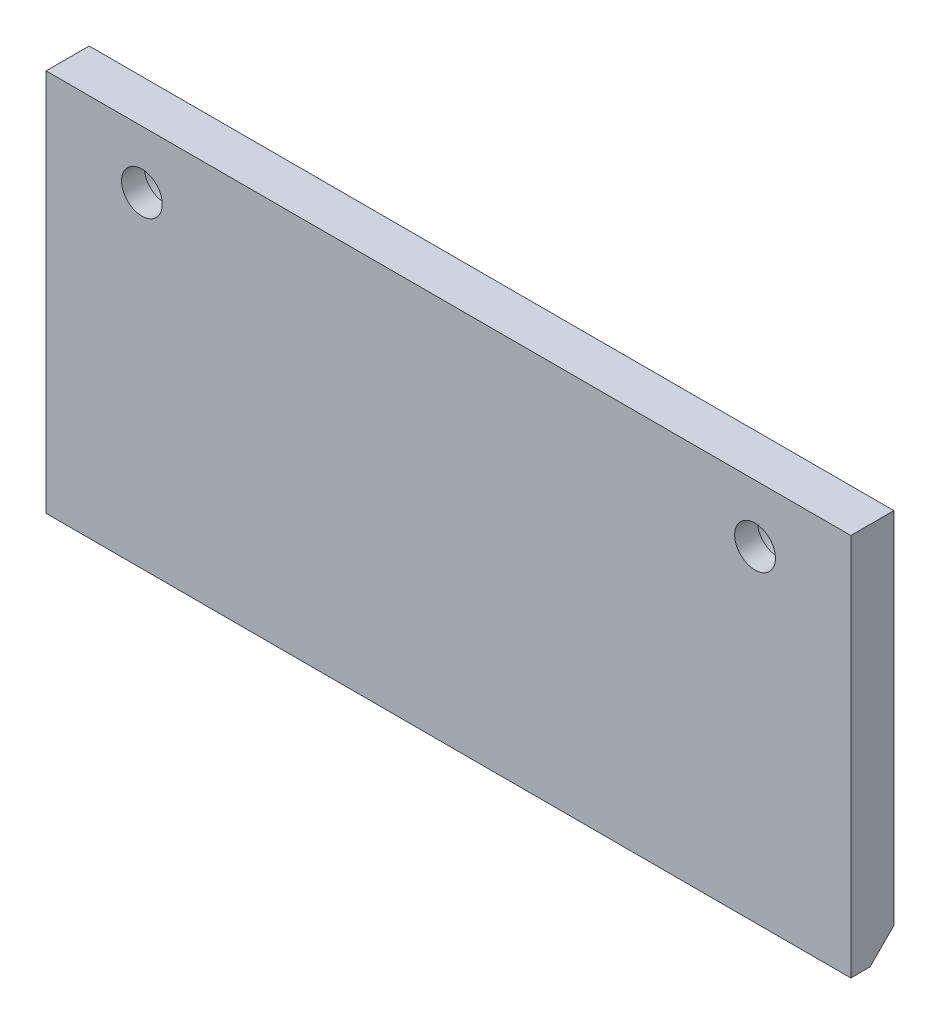
ISO-10303-21;
HEADER;
FILE_DESCRIPTION(('STEP AP214'),'2;1');
FILE_NAME('part.step','',(''),(''),'','','');
FILE_SCHEMA(('AUTOMOTIVE_DESIGN { 1 0 10303 214 1 1 1 1 }'));
ENDSEC;
DATA;
#1=APPLICATION_CONTEXT('core data for automotive mechanical design processes');
#2=APPLICATION_PROTOCOL_DEFINITION('international standard','automotive_design',2000,#1);
#3=PRODUCT_CONTEXT('',#1,'mechanical');
#4=PRODUCT('Part','Part','',(#3));
#5=PRODUCT_RELATED_PRODUCT_CATEGORY('part','',(#4));
#6=PRODUCT_DEFINITION_FORMATION('','',#4);
#7=PRODUCT_DEFINITION_CONTEXT('part definition',#1,'design');
#8=PRODUCT_DEFINITION('design','',#6,#7);
#9=PRODUCT_DEFINITION_SHAPE('','',#8);
#10=(LENGTH_UNIT() NAMED_UNIT(*) SI_UNIT(.MILLI.,.METRE.));
#11=(NAMED_UNIT(*) PLANE_ANGLE_UNIT() SI_UNIT($,.RADIAN.));
#12=(NAMED_UNIT(*) SI_UNIT($,.STERADIAN.) SOLID_ANGLE_UNIT());
#13=UNCERTAINTY_MEASURE_WITH_UNIT(LENGTH_MEASURE(1.E-05),#10,'distance_accuracy_value','');
#14=(GEOMETRIC_REPRESENTATION_CONTEXT(3) GLOBAL_UNCERTAINTY_ASSIGNED_CONTEXT((#13)) GLOBAL_UNIT_ASSIGNED_CONTEXT((#10,
#11,#12)) REPRESENTATION_CONTEXT('',''));
#15=CARTESIAN_POINT('',(0.,0.,0.));
#16=DIRECTION('',(0.,0.,1.));
#17=DIRECTION('',(1.,0.,0.));
#18=AXIS2_PLACEMENT_3D('',#15,#16,#17);
#19=CARTESIAN_POINT('',(-66.675,31.75,-3.5687));
#20=DIRECTION('',(-1.,0.,0.));
#21=DIRECTION('',(0.,-1.,0.));
#22=AXIS2_PLACEMENT_3D('',#19,#20,#21);
#23=PLANE('',#22);
#24=DIRECTION('',(0.,0.707106781186544,-0.707106781186551));
#25=VECTOR('',#24,1.);
#26=CARTESIAN_POINT('',(-66.675,-31.75,0.3937));
#27=LINE('',#26,#25);
#28=CARTESIAN_POINT('',(-66.675,-31.75,0.3937));
#29=VERTEX_POINT('',#28);
#30=CARTESIAN_POINT('',(-66.675,-27.7876,-3.5687));
#31=VERTEX_POINT('',#30);
#32=EDGE_CURVE('E59',#29,#31,#27,.T.);
#33=ORIENTED_EDGE('',*,*,#32,.F.);
#34=DIRECTION('',(0.,0.,1.));
#35=VECTOR('',#34,1.);
#36=CARTESIAN_POINT('',(-66.675,-31.75,-3.5687));
#37=LINE('',#36,#35);
#38=CARTESIAN_POINT('',(-66.675,-31.75,3.5687));
#39=VERTEX_POINT('',#38);
#40=EDGE_CURVE('E46',#29,#39,#37,.T.);
#41=ORIENTED_EDGE('',*,*,#40,.T.);
#42=DIRECTION('',(0.,-1.,0.));
#43=VECTOR('',#42,1.);
#44=CARTESIAN_POINT('',(-66.675,31.75,3.5687));
#45=LINE('',#44,#43);
#46=CARTESIAN_POINT('',(-66.675,31.75,3.5687));
#47=VERTEX_POINT('',#46);
#48=EDGE_CURVE('E92',#47,#39,#45,.T.);
#49=ORIENTED_EDGE('',*,*,#48,.F.);
#50=DIRECTION('',(0.,0.,1.));
#51=VECTOR('',#50,1.);
#52=CARTESIAN_POINT('',(-66.675,31.75,-3.5687));
#53=LINE('',#52,#51);
#54=CARTESIAN_POINT('',(-66.675,31.75,-3.5687));
#55=VERTEX_POINT('',#54);
#56=EDGE_CURVE('E11',#55,#47,#53,.T.);
#57=ORIENTED_EDGE('',*,*,#56,.F.);
#58=DIRECTION('',(0.,-1.,0.));
#59=VECTOR('',#58,1.);
#60=CARTESIAN_POINT('',(-66.675,31.75,-3.5687));
#61=LINE('',#60,#59);
#62=EDGE_CURVE('E104',#55,#31,#61,.T.);
#63=ORIENTED_EDGE('',*,*,#62,.T.);
#64=EDGE_LOOP('',(#33,#41,#49,#57,#63));
#65=FACE_BOUND('',#64,.T.);
#66=ADVANCED_FACE('F43',(#65),#23,.T.);
#67=CARTESIAN_POINT('',(66.675,31.75,-3.5687));
#68=DIRECTION('',(0.,1.,0.));
#69=DIRECTION('',(-1.,0.,0.));
#70=AXIS2_PLACEMENT_3D('',#67,#68,#69);
#71=PLANE('',#70);
#72=DIRECTION('',(-1.,0.,0.));
#73=VECTOR('',#72,1.);
#74=CARTESIAN_POINT('',(66.675,31.75,3.5687));
#75=LINE('',#74,#73);
#76=CARTESIAN_POINT('',(66.675,31.75,3.5687));
#77=VERTEX_POINT('',#76);
#78=EDGE_CURVE('E88',#77,#47,#75,.T.);
#79=ORIENTED_EDGE('',*,*,#78,.F.);
#80=DIRECTION('',(0.,0.,1.));
#81=VECTOR('',#80,1.);
#82=CARTESIAN_POINT('',(66.675,31.75,-3.5687));
#83=LINE('',#82,#81);
#84=CARTESIAN_POINT('',(66.675,31.75,-3.5687));
#85=VERTEX_POINT('',#84);
#86=EDGE_CURVE('E51',#85,#77,#83,.T.);
#87=ORIENTED_EDGE('',*,*,#86,.F.);
#88=DIRECTION('',(-1.,0.,0.));
#89=VECTOR('',#88,1.);
#90=CARTESIAN_POINT('',(66.675,31.75,-3.5687));
#91=LINE('',#90,#89);
#92=EDGE_CURVE('E90',#85,#55,#91,.T.);
#93=ORIENTED_EDGE('',*,*,#92,.T.);
#94=ORIENTED_EDGE('',*,*,#56,.T.);
#95=EDGE_LOOP('',(#79,#87,#93,#94));
#96=FACE_BOUND('',#95,.T.);
#97=ADVANCED_FACE('F85',(#96),#71,.T.);
#98=CARTESIAN_POINT('',(66.675,31.75,-3.5687));
#99=DIRECTION('',(1.,0.,0.));
#100=DIRECTION('',(0.,1.,0.));
#101=AXIS2_PLACEMENT_3D('',#98,#99,#100);
#102=PLANE('',#101);
#103=DIRECTION('',(0.,0.707106781186544,-0.707106781186551));
#104=VECTOR('',#103,1.);
#105=CARTESIAN_POINT('',(66.675,-31.75,0.3937));
#106=LINE('',#105,#104);
#107=CARTESIAN_POINT('',(66.675,-31.75,0.3937));
#108=VERTEX_POINT('',#107);
#109=CARTESIAN_POINT('',(66.675,-27.7876,-3.5687));
#110=VERTEX_POINT('',#109);
#111=EDGE_CURVE('E126',#108,#110,#106,.T.);
#112=ORIENTED_EDGE('',*,*,#111,.T.);
#113=DIRECTION('',(0.,1.,0.));
#114=VECTOR('',#113,1.);
#115=CARTESIAN_POINT('',(66.675,31.75,-3.5687));
#116=LINE('',#115,#114);
#117=EDGE_CURVE('E106',#110,#85,#116,.T.);
#118=ORIENTED_EDGE('',*,*,#117,.T.);
#119=ORIENTED_EDGE('',*,*,#86,.T.);
#120=DIRECTION('',(0.,1.,0.));
#121=VECTOR('',#120,1.);
#122=CARTESIAN_POINT('',(66.675,31.75,3.5687));
#123=LINE('',#122,#121);
#124=CARTESIAN_POINT('',(66.675,-31.75,3.5687));
#125=VERTEX_POINT('',#124);
#126=EDGE_CURVE('E103',#125,#77,#123,.T.);
#127=ORIENTED_EDGE('',*,*,#126,.F.);
#128=DIRECTION('',(0.,0.,1.));
#129=VECTOR('',#128,1.);
#130=CARTESIAN_POINT('',(66.675,-31.75,-3.5687));
#131=LINE('',#130,#129);
#132=EDGE_CURVE('E111',#108,#125,#131,.T.);
#133=ORIENTED_EDGE('',*,*,#132,.F.);
#134=EDGE_LOOP('',(#112,#118,#119,#127,#133));
#135=FACE_BOUND('',#134,.T.);
#136=ADVANCED_FACE('F131',(#135),#102,.T.);
#137=CARTESIAN_POINT('',(66.675,-31.75,-3.5687));
#138=DIRECTION('',(0.,-1.,0.));
#139=DIRECTION('',(1.,0.,0.));
#140=AXIS2_PLACEMENT_3D('',#137,#138,#139);
#141=PLANE('',#140);
#142=DIRECTION('',(-1.,0.,0.));
#143=VECTOR('',#142,1.);
#144=CARTESIAN_POINT('',(66.675,-31.75,0.3937));
#145=LINE('',#144,#143);
#146=EDGE_CURVE('E120',#108,#29,#145,.T.);
#147=ORIENTED_EDGE('',*,*,#146,.F.);
#148=ORIENTED_EDGE('',*,*,#132,.T.);
#149=DIRECTION('',(1.,0.,0.));
#150=VECTOR('',#149,1.);
#151=CARTESIAN_POINT('',(66.675,-31.75,3.5687));
#152=LINE('',#151,#150);
#153=EDGE_CURVE('E97',#39,#125,#152,.T.);
#154=ORIENTED_EDGE('',*,*,#153,.F.);
#155=ORIENTED_EDGE('',*,*,#40,.F.);
#156=EDGE_LOOP('',(#147,#148,#154,#155));
#157=FACE_BOUND('',#156,.T.);
#158=ADVANCED_FACE('F117',(#157),#141,.T.);
#159=CARTESIAN_POINT('',(0.,0.,-3.5687));
#160=DIRECTION('',(0.,0.,-1.));
#161=DIRECTION('',(-1.,0.,0.));
#162=AXIS2_PLACEMENT_3D('',#159,#160,#161);
#163=PLANE('',#162);
#164=CARTESIAN_POINT('',(50.8,22.225,-3.5687));
#165=DIRECTION('',(0.,0.,-1.));
#166=DIRECTION('',(-1.,0.,0.));
#167=AXIS2_PLACEMENT_3D('',#164,#165,#166);
#168=CIRCLE('',#167,5.95376);
#169=CARTESIAN_POINT('',(44.84624,22.225,-3.5687));
#170=VERTEX_POINT('',#169);
#171=EDGE_CURVE('E158',#170,#170,#168,.T.);
#172=ORIENTED_EDGE('',*,*,#171,.F.);
#173=EDGE_LOOP('',(#172));
#174=FACE_BOUND('',#173,.T.);
#175=CARTESIAN_POINT('',(-50.8,22.225,-3.5687));
#176=DIRECTION('',(0.,0.,-1.));
#177=DIRECTION('',(-1.,0.,0.));
#178=AXIS2_PLACEMENT_3D('',#175,#176,#177);
#179=CIRCLE('',#178,5.95376);
#180=CARTESIAN_POINT('',(-56.75376,22.225,-3.5687));
#181=VERTEX_POINT('',#180);
#182=EDGE_CURVE('E146',#181,#181,#179,.T.);
#183=ORIENTED_EDGE('',*,*,#182,.F.);
#184=EDGE_LOOP('',(#183));
#185=FACE_BOUND('',#184,.T.);
#186=DIRECTION('',(-1.,0.,0.));
#187=VECTOR('',#186,1.);
#188=CARTESIAN_POINT('',(66.675,-27.7876,-3.5687));
#189=LINE('',#188,#187);
#190=EDGE_CURVE('E98',#110,#31,#189,.T.);
#191=ORIENTED_EDGE('',*,*,#190,.T.);
#192=ORIENTED_EDGE('',*,*,#62,.F.);
#193=ORIENTED_EDGE('',*,*,#92,.F.);
#194=ORIENTED_EDGE('',*,*,#117,.F.);
#195=EDGE_LOOP('',(#191,#192,#193,#194));
#196=FACE_BOUND('',#195,.T.);
#197=ADVANCED_FACE('F133',(#174,#185,#196),#163,.T.);
#198=CARTESIAN_POINT('',(0.,0.,3.5687));
#199=DIRECTION('',(0.,0.,-1.));
#200=DIRECTION('',(-1.,0.,0.));
#201=AXIS2_PLACEMENT_3D('',#198,#199,#200);
#202=PLANE('',#201);
#203=CARTESIAN_POINT('',(50.8,22.225,3.5687));
#204=DIRECTION('',(0.,0.,-1.));
#205=DIRECTION('',(-1.,0.,0.));
#206=AXIS2_PLACEMENT_3D('',#203,#204,#205);
#207=CIRCLE('',#206,3.3782);
#208=CARTESIAN_POINT('',(47.4218,22.225,3.5687));
#209=VERTEX_POINT('',#208);
#210=EDGE_CURVE('E149',#209,#209,#207,.T.);
#211=ORIENTED_EDGE('',*,*,#210,.T.);
#212=EDGE_LOOP('',(#211));
#213=FACE_BOUND('',#212,.T.);
#214=CARTESIAN_POINT('',(-50.8,22.225,3.5687));
#215=DIRECTION('',(0.,0.,-1.));
#216=DIRECTION('',(-1.,0.,0.));
#217=AXIS2_PLACEMENT_3D('',#214,#215,#216);
#218=CIRCLE('',#217,3.3782);
#219=CARTESIAN_POINT('',(-54.1782,22.225,3.5687));
#220=VERTEX_POINT('',#219);
#221=EDGE_CURVE('E134',#220,#220,#218,.T.);
#222=ORIENTED_EDGE('',*,*,#221,.T.);
#223=EDGE_LOOP('',(#222));
#224=FACE_BOUND('',#223,.T.);
#225=ORIENTED_EDGE('',*,*,#48,.T.);
#226=ORIENTED_EDGE('',*,*,#153,.T.);
#227=ORIENTED_EDGE('',*,*,#126,.T.);
#228=ORIENTED_EDGE('',*,*,#78,.T.);
#229=EDGE_LOOP('',(#225,#226,#227,#228));
#230=FACE_BOUND('',#229,.T.);
#231=ADVANCED_FACE('F101',(#213,#224,#230),#202,.F.);
#232=CARTESIAN_POINT('',(66.675,-31.75,0.3937));
#233=DIRECTION('',(0.,0.707106781186551,0.707106781186544));
#234=DIRECTION('',(0.,-0.707106781186544,0.707106781186551));
#235=AXIS2_PLACEMENT_3D('',#232,#233,#234);
#236=PLANE('',#235);
#237=ORIENTED_EDGE('',*,*,#32,.T.);
#238=ORIENTED_EDGE('',*,*,#190,.F.);
#239=ORIENTED_EDGE('',*,*,#111,.F.);
#240=ORIENTED_EDGE('',*,*,#146,.T.);
#241=EDGE_LOOP('',(#237,#238,#239,#240));
#242=FACE_BOUND('',#241,.T.);
#243=ADVANCED_FACE('F125',(#242),#236,.F.);
#244=CARTESIAN_POINT('',(-50.8,22.225,-3.5687));
#245=DIRECTION('',(0.,0.,-1.));
#246=DIRECTION('',(-1.,0.,0.));
#247=AXIS2_PLACEMENT_3D('',#244,#245,#246);
#248=CYLINDRICAL_SURFACE('',#247,3.3782);
#249=ORIENTED_EDGE('',*,*,#221,.F.);
#250=EDGE_LOOP('',(#249));
#251=FACE_BOUND('',#250,.T.);
#252=CARTESIAN_POINT('',(-50.8,22.225,-0.215900000000001));
#253=DIRECTION('',(0.,0.,-1.));
#254=DIRECTION('',(-1.,0.,0.));
#255=AXIS2_PLACEMENT_3D('',#252,#253,#254);
#256=CIRCLE('',#255,3.3782);
#257=CARTESIAN_POINT('',(-54.1782,22.225,-0.215900000000001));
#258=VERTEX_POINT('',#257);
#259=EDGE_CURVE('E137',#258,#258,#256,.T.);
#260=ORIENTED_EDGE('',*,*,#259,.T.);
#261=EDGE_LOOP('',(#260));
#262=FACE_BOUND('',#261,.T.);
#263=ADVANCED_FACE('F182',(#251,#262),#248,.F.);
#264=CARTESIAN_POINT('',(-47.4218,22.225,-0.215900000000001));
#265=DIRECTION('',(0.,0.,1.));
#266=DIRECTION('',(1.,0.,0.));
#267=AXIS2_PLACEMENT_3D('',#264,#265,#266);
#268=PLANE('',#267);
#269=ORIENTED_EDGE('',*,*,#259,.F.);
#270=EDGE_LOOP('',(#269));
#271=FACE_BOUND('',#270,.T.);
#272=CARTESIAN_POINT('',(-50.8,22.225,-0.215900000000001));
#273=DIRECTION('',(0.,0.,-1.));
#274=DIRECTION('',(-1.,0.,0.));
#275=AXIS2_PLACEMENT_3D('',#272,#273,#274);
#276=CIRCLE('',#275,5.95376);
#277=CARTESIAN_POINT('',(-56.75376,22.225,-0.215900000000001));
#278=VERTEX_POINT('',#277);
#279=EDGE_CURVE('E143',#278,#278,#276,.T.);
#280=ORIENTED_EDGE('',*,*,#279,.T.);
#281=EDGE_LOOP('',(#280));
#282=FACE_BOUND('',#281,.T.);
#283=ADVANCED_FACE('F172',(#271,#282),#268,.F.);
#284=CARTESIAN_POINT('',(-50.8,22.225,-3.5687));
#285=DIRECTION('',(0.,0.,-1.));
#286=DIRECTION('',(-1.,0.,0.));
#287=AXIS2_PLACEMENT_3D('',#284,#285,#286);
#288=CYLINDRICAL_SURFACE('',#287,5.95376);
#289=ORIENTED_EDGE('',*,*,#279,.F.);
#290=EDGE_LOOP('',(#289));
#291=FACE_BOUND('',#290,.T.);
#292=ORIENTED_EDGE('',*,*,#182,.T.);
#293=EDGE_LOOP('',(#292));
#294=FACE_BOUND('',#293,.T.);
#295=ADVANCED_FACE('F169',(#291,#294),#288,.F.);
#296=CARTESIAN_POINT('',(50.8,22.225,-3.5687));
#297=DIRECTION('',(0.,0.,-1.));
#298=DIRECTION('',(-1.,0.,0.));
#299=AXIS2_PLACEMENT_3D('',#296,#297,#298);
#300=CYLINDRICAL_SURFACE('',#299,3.3782);
#301=ORIENTED_EDGE('',*,*,#210,.F.);
#302=EDGE_LOOP('',(#301));
#303=FACE_BOUND('',#302,.T.);
#304=CARTESIAN_POINT('',(50.8,22.225,-0.215900000000001));
#305=DIRECTION('',(0.,0.,-1.));
#306=DIRECTION('',(-1.,0.,0.));
#307=AXIS2_PLACEMENT_3D('',#304,#305,#306);
#308=CIRCLE('',#307,3.3782);
#309=CARTESIAN_POINT('',(47.4218,22.225,-0.215900000000001));
#310=VERTEX_POINT('',#309);
#311=EDGE_CURVE('E152',#310,#310,#308,.T.);
#312=ORIENTED_EDGE('',*,*,#311,.T.);
#313=EDGE_LOOP('',(#312));
#314=FACE_BOUND('',#313,.T.);
#315=ADVANCED_FACE('F171',(#303,#314),#300,.F.);
#316=CARTESIAN_POINT('',(54.1782,22.225,-0.215900000000001));
#317=DIRECTION('',(0.,0.,1.));
#318=DIRECTION('',(1.,0.,0.));
#319=AXIS2_PLACEMENT_3D('',#316,#317,#318);
#320=PLANE('',#319);
#321=ORIENTED_EDGE('',*,*,#311,.F.);
#322=EDGE_LOOP('',(#321));
#323=FACE_BOUND('',#322,.T.);
#324=CARTESIAN_POINT('',(50.8,22.225,-0.215900000000001));
#325=DIRECTION('',(0.,0.,-1.));
#326=DIRECTION('',(-1.,0.,0.));
#327=AXIS2_PLACEMENT_3D('',#324,#325,#326);
#328=CIRCLE('',#327,5.95376);
#329=CARTESIAN_POINT('',(44.84624,22.225,-0.215900000000001));
#330=VERTEX_POINT('',#329);
#331=EDGE_CURVE('E155',#330,#330,#328,.T.);
#332=ORIENTED_EDGE('',*,*,#331,.T.);
#333=EDGE_LOOP('',(#332));
#334=FACE_BOUND('',#333,.T.);
#335=ADVANCED_FACE('F179',(#323,#334),#320,.F.);
#336=CARTESIAN_POINT('',(50.8,22.225,-3.5687));
#337=DIRECTION('',(0.,0.,-1.));
#338=DIRECTION('',(-1.,0.,0.));
#339=AXIS2_PLACEMENT_3D('',#336,#337,#338);
#340=CYLINDRICAL_SURFACE('',#339,5.95376);
#341=ORIENTED_EDGE('',*,*,#331,.F.);
#342=EDGE_LOOP('',(#341));
#343=FACE_BOUND('',#342,.T.);
#344=ORIENTED_EDGE('',*,*,#171,.T.);
#345=EDGE_LOOP('',(#344));
#346=FACE_BOUND('',#345,.T.);
#347=ADVANCED_FACE('F162',(#343,#346),#340,.F.);
#348=CLOSED_SHELL('',(#66,#97,#136,#158,#197,#231,#243,#263,#283,#295,#315,#335,#347));
#349=MANIFOLD_SOLID_BREP('B2',#348);
#350=ADVANCED_BREP_SHAPE_REPRESENTATION('',(#18,#349),#14);
#351=SHAPE_DEFINITION_REPRESENTATION(#9,#350);
ENDSEC;
END-ISO-10303-21;
